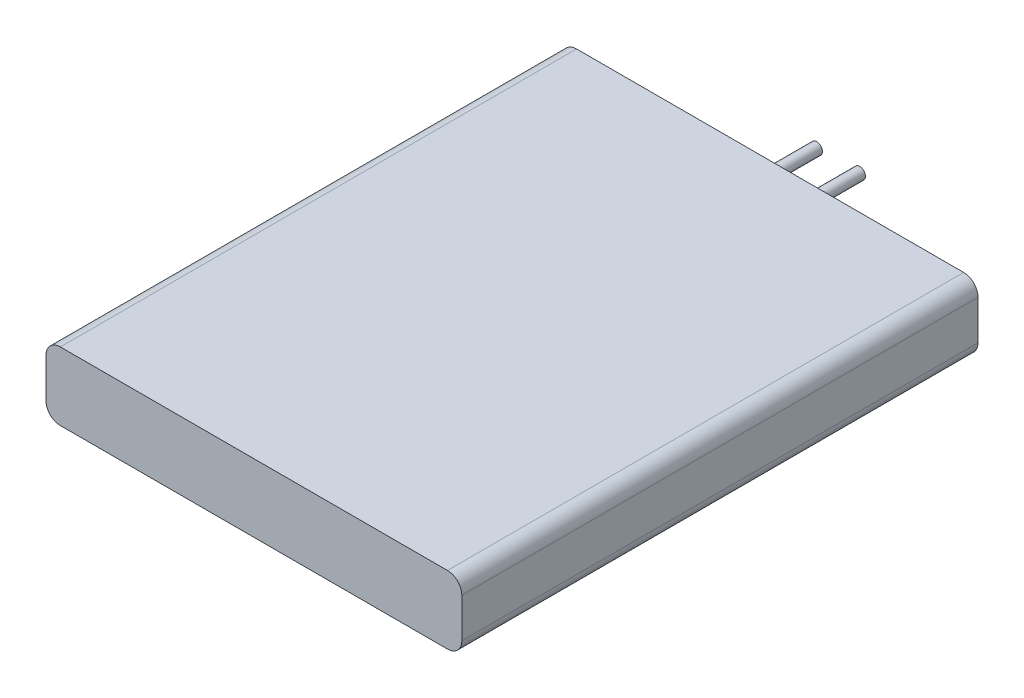
ISO-10303-21;
HEADER;
FILE_DESCRIPTION(('STEP AP214'),'2;1');
FILE_NAME('part.step','',(''),(''),'','','');
FILE_SCHEMA(('AUTOMOTIVE_DESIGN { 1 0 10303 214 1 1 1 1 }'));
ENDSEC;
DATA;
#1=APPLICATION_CONTEXT('core data for automotive mechanical design processes');
#2=APPLICATION_PROTOCOL_DEFINITION('international standard','automotive_design',2000,#1);
#3=PRODUCT_CONTEXT('',#1,'mechanical');
#4=PRODUCT('Part','Part','',(#3));
#5=PRODUCT_RELATED_PRODUCT_CATEGORY('part','',(#4));
#6=PRODUCT_DEFINITION_FORMATION('','',#4);
#7=PRODUCT_DEFINITION_CONTEXT('part definition',#1,'design');
#8=PRODUCT_DEFINITION('design','',#6,#7);
#9=PRODUCT_DEFINITION_SHAPE('','',#8);
#10=(LENGTH_UNIT() NAMED_UNIT(*) SI_UNIT(.MILLI.,.METRE.));
#11=(NAMED_UNIT(*) PLANE_ANGLE_UNIT() SI_UNIT($,.RADIAN.));
#12=(NAMED_UNIT(*) SI_UNIT($,.STERADIAN.) SOLID_ANGLE_UNIT());
#13=UNCERTAINTY_MEASURE_WITH_UNIT(LENGTH_MEASURE(1.E-05),#10,'distance_accuracy_value','');
#14=(GEOMETRIC_REPRESENTATION_CONTEXT(3) GLOBAL_UNCERTAINTY_ASSIGNED_CONTEXT((#13)) GLOBAL_UNIT_ASSIGNED_CONTEXT((#10,
#11,#12)) REPRESENTATION_CONTEXT('',''));
#15=CARTESIAN_POINT('',(0.,0.,0.));
#16=DIRECTION('',(0.,0.,1.));
#17=DIRECTION('',(1.,0.,0.));
#18=AXIS2_PLACEMENT_3D('',#15,#16,#17);
#19=CARTESIAN_POINT('',(14.5,4.75,18.));
#20=DIRECTION('',(-1.,0.,0.));
#21=DIRECTION('',(0.,0.,1.));
#22=AXIS2_PLACEMENT_3D('',#19,#20,#21);
#23=PLANE('',#22);
#24=DIRECTION('',(0.,-1.,0.));
#25=VECTOR('',#24,1.);
#26=CARTESIAN_POINT('',(14.5,4.75,18.));
#27=LINE('',#26,#25);
#28=CARTESIAN_POINT('',(14.5,3.75,18.));
#29=VERTEX_POINT('',#28);
#30=CARTESIAN_POINT('',(14.5,1.,18.));
#31=VERTEX_POINT('',#30);
#32=EDGE_CURVE('E124',#29,#31,#27,.T.);
#33=ORIENTED_EDGE('',*,*,#32,.T.);
#34=DIRECTION('',(0.,0.,-1.));
#35=VECTOR('',#34,1.);
#36=CARTESIAN_POINT('',(14.5,1.,-18.));
#37=LINE('',#36,#35);
#38=CARTESIAN_POINT('',(14.5,1.,-18.));
#39=VERTEX_POINT('',#38);
#40=EDGE_CURVE('E11',#31,#39,#37,.T.);
#41=ORIENTED_EDGE('',*,*,#40,.T.);
#42=DIRECTION('',(0.,-1.,0.));
#43=VECTOR('',#42,1.);
#44=CARTESIAN_POINT('',(14.5,4.75,-18.));
#45=LINE('',#44,#43);
#46=CARTESIAN_POINT('',(14.5,3.75,-18.));
#47=VERTEX_POINT('',#46);
#48=EDGE_CURVE('E158',#47,#39,#45,.T.);
#49=ORIENTED_EDGE('',*,*,#48,.F.);
#50=DIRECTION('',(0.,0.,-1.));
#51=VECTOR('',#50,1.);
#52=CARTESIAN_POINT('',(14.5,3.75,18.));
#53=LINE('',#52,#51);
#54=EDGE_CURVE('E44',#47,#29,#53,.F.);
#55=ORIENTED_EDGE('',*,*,#54,.T.);
#56=EDGE_LOOP('',(#33,#41,#49,#55));
#57=FACE_BOUND('',#56,.T.);
#58=ADVANCED_FACE('F36',(#57),#23,.F.);
#59=CARTESIAN_POINT('',(-14.5,4.75,-18.));
#60=DIRECTION('',(0.,0.,1.));
#61=DIRECTION('',(1.,0.,0.));
#62=AXIS2_PLACEMENT_3D('',#59,#60,#61);
#63=PLANE('',#62);
#64=CARTESIAN_POINT('',(1.5,2.375,-18.));
#65=DIRECTION('',(0.,0.,1.));
#66=DIRECTION('',(1.,0.,0.));
#67=AXIS2_PLACEMENT_3D('',#64,#65,#66);
#68=CIRCLE('',#67,0.4);
#69=CARTESIAN_POINT('',(1.9,2.375,-18.));
#70=VERTEX_POINT('',#69);
#71=EDGE_CURVE('E129',#70,#70,#68,.F.);
#72=ORIENTED_EDGE('',*,*,#71,.F.);
#73=EDGE_LOOP('',(#72));
#74=FACE_BOUND('',#73,.T.);
#75=CARTESIAN_POINT('',(-1.5,2.375,-18.));
#76=DIRECTION('',(0.,0.,1.));
#77=DIRECTION('',(1.,0.,0.));
#78=AXIS2_PLACEMENT_3D('',#75,#76,#77);
#79=CIRCLE('',#78,0.4);
#80=CARTESIAN_POINT('',(-1.1,2.375,-18.));
#81=VERTEX_POINT('',#80);
#82=EDGE_CURVE('E134',#81,#81,#79,.F.);
#83=ORIENTED_EDGE('',*,*,#82,.F.);
#84=EDGE_LOOP('',(#83));
#85=FACE_BOUND('',#84,.T.);
#86=DIRECTION('',(-1.,0.,0.));
#87=VECTOR('',#86,1.);
#88=CARTESIAN_POINT('',(-14.5,0.,-18.));
#89=LINE('',#88,#87);
#90=CARTESIAN_POINT('',(13.5,0.,-18.));
#91=VERTEX_POINT('',#90);
#92=CARTESIAN_POINT('',(-13.5,0.,-18.));
#93=VERTEX_POINT('',#92);
#94=EDGE_CURVE('E174',#91,#93,#89,.T.);
#95=ORIENTED_EDGE('',*,*,#94,.T.);
#96=CARTESIAN_POINT('',(-13.5,1.,-18.));
#97=DIRECTION('',(0.,0.,1.));
#98=DIRECTION('',(1.,0.,0.));
#99=AXIS2_PLACEMENT_3D('',#96,#97,#98);
#100=CIRCLE('',#99,1.);
#101=CARTESIAN_POINT('',(-14.5,1.,-18.));
#102=VERTEX_POINT('',#101);
#103=EDGE_CURVE('E148',#93,#102,#100,.F.);
#104=ORIENTED_EDGE('',*,*,#103,.T.);
#105=DIRECTION('',(0.,-1.,0.));
#106=VECTOR('',#105,1.);
#107=CARTESIAN_POINT('',(-14.5,4.75,-18.));
#108=LINE('',#107,#106);
#109=CARTESIAN_POINT('',(-14.5,3.75,-18.));
#110=VERTEX_POINT('',#109);
#111=EDGE_CURVE('E123',#110,#102,#108,.T.);
#112=ORIENTED_EDGE('',*,*,#111,.F.);
#113=CARTESIAN_POINT('',(-13.5,3.75,-18.));
#114=DIRECTION('',(0.,0.,1.));
#115=DIRECTION('',(1.,0.,0.));
#116=AXIS2_PLACEMENT_3D('',#113,#114,#115);
#117=CIRCLE('',#116,1.);
#118=CARTESIAN_POINT('',(-13.5,4.75,-18.));
#119=VERTEX_POINT('',#118);
#120=EDGE_CURVE('E128',#110,#119,#117,.F.);
#121=ORIENTED_EDGE('',*,*,#120,.T.);
#122=DIRECTION('',(-1.,0.,0.));
#123=VECTOR('',#122,1.);
#124=CARTESIAN_POINT('',(-14.5,4.75,-18.));
#125=LINE('',#124,#123);
#126=CARTESIAN_POINT('',(13.5,4.75,-18.));
#127=VERTEX_POINT('',#126);
#128=EDGE_CURVE('E168',#127,#119,#125,.T.);
#129=ORIENTED_EDGE('',*,*,#128,.F.);
#130=CARTESIAN_POINT('',(13.5,3.75,-18.));
#131=DIRECTION('',(0.,0.,1.));
#132=DIRECTION('',(1.,0.,0.));
#133=AXIS2_PLACEMENT_3D('',#130,#131,#132);
#134=CIRCLE('',#133,1.);
#135=EDGE_CURVE('E58',#127,#47,#134,.F.);
#136=ORIENTED_EDGE('',*,*,#135,.T.);
#137=ORIENTED_EDGE('',*,*,#48,.T.);
#138=CARTESIAN_POINT('',(13.5,1.,-18.));
#139=DIRECTION('',(0.,0.,1.));
#140=DIRECTION('',(1.,0.,0.));
#141=AXIS2_PLACEMENT_3D('',#138,#139,#140);
#142=CIRCLE('',#141,1.);
#143=EDGE_CURVE('E51',#39,#91,#142,.F.);
#144=ORIENTED_EDGE('',*,*,#143,.T.);
#145=EDGE_LOOP('',(#95,#104,#112,#121,#129,#136,#137,#144));
#146=FACE_BOUND('',#145,.T.);
#147=ADVANCED_FACE('F170',(#74,#85,#146),#63,.F.);
#148=CARTESIAN_POINT('',(-14.5,4.75,18.));
#149=DIRECTION('',(1.,0.,0.));
#150=DIRECTION('',(0.,0.,-1.));
#151=AXIS2_PLACEMENT_3D('',#148,#149,#150);
#152=PLANE('',#151);
#153=ORIENTED_EDGE('',*,*,#111,.T.);
#154=DIRECTION('',(0.,0.,1.));
#155=VECTOR('',#154,1.);
#156=CARTESIAN_POINT('',(-14.5,1.,18.));
#157=LINE('',#156,#155);
#158=CARTESIAN_POINT('',(-14.5,1.,18.));
#159=VERTEX_POINT('',#158);
#160=EDGE_CURVE('E122',#102,#159,#157,.T.);
#161=ORIENTED_EDGE('',*,*,#160,.T.);
#162=DIRECTION('',(0.,-1.,0.));
#163=VECTOR('',#162,1.);
#164=CARTESIAN_POINT('',(-14.5,4.75,18.));
#165=LINE('',#164,#163);
#166=CARTESIAN_POINT('',(-14.5,3.75,18.));
#167=VERTEX_POINT('',#166);
#168=EDGE_CURVE('E105',#167,#159,#165,.T.);
#169=ORIENTED_EDGE('',*,*,#168,.F.);
#170=DIRECTION('',(0.,0.,1.));
#171=VECTOR('',#170,1.);
#172=CARTESIAN_POINT('',(-14.5,3.75,18.));
#173=LINE('',#172,#171);
#174=EDGE_CURVE('E119',#167,#110,#173,.F.);
#175=ORIENTED_EDGE('',*,*,#174,.T.);
#176=EDGE_LOOP('',(#153,#161,#169,#175));
#177=FACE_BOUND('',#176,.T.);
#178=ADVANCED_FACE('F118',(#177),#152,.F.);
#179=CARTESIAN_POINT('',(-14.5,4.75,18.));
#180=DIRECTION('',(0.,0.,-1.));
#181=DIRECTION('',(-1.,0.,0.));
#182=AXIS2_PLACEMENT_3D('',#179,#180,#181);
#183=PLANE('',#182);
#184=ORIENTED_EDGE('',*,*,#168,.T.);
#185=CARTESIAN_POINT('',(-13.5,1.,18.));
#186=DIRECTION('',(0.,0.,-1.));
#187=DIRECTION('',(-1.,0.,0.));
#188=AXIS2_PLACEMENT_3D('',#185,#186,#187);
#189=CIRCLE('',#188,1.);
#190=CARTESIAN_POINT('',(-13.5,0.,18.));
#191=VERTEX_POINT('',#190);
#192=EDGE_CURVE('E112',#159,#191,#189,.F.);
#193=ORIENTED_EDGE('',*,*,#192,.T.);
#194=DIRECTION('',(1.,0.,0.));
#195=VECTOR('',#194,1.);
#196=CARTESIAN_POINT('',(-14.5,0.,18.));
#197=LINE('',#196,#195);
#198=CARTESIAN_POINT('',(13.5,0.,18.));
#199=VERTEX_POINT('',#198);
#200=EDGE_CURVE('E171',#191,#199,#197,.T.);
#201=ORIENTED_EDGE('',*,*,#200,.T.);
#202=CARTESIAN_POINT('',(13.5,1.,18.));
#203=DIRECTION('',(0.,0.,-1.));
#204=DIRECTION('',(-1.,0.,0.));
#205=AXIS2_PLACEMENT_3D('',#202,#203,#204);
#206=CIRCLE('',#205,1.);
#207=EDGE_CURVE('E113',#199,#31,#206,.F.);
#208=ORIENTED_EDGE('',*,*,#207,.T.);
#209=ORIENTED_EDGE('',*,*,#32,.F.);
#210=CARTESIAN_POINT('',(13.5,3.75,18.));
#211=DIRECTION('',(0.,0.,-1.));
#212=DIRECTION('',(-1.,0.,0.));
#213=AXIS2_PLACEMENT_3D('',#210,#211,#212);
#214=CIRCLE('',#213,1.);
#215=CARTESIAN_POINT('',(13.5,4.75,18.));
#216=VERTEX_POINT('',#215);
#217=EDGE_CURVE('E131',#29,#216,#214,.F.);
#218=ORIENTED_EDGE('',*,*,#217,.T.);
#219=DIRECTION('',(1.,0.,0.));
#220=VECTOR('',#219,1.);
#221=CARTESIAN_POINT('',(-14.5,4.75,18.));
#222=LINE('',#221,#220);
#223=CARTESIAN_POINT('',(-13.5,4.75,18.));
#224=VERTEX_POINT('',#223);
#225=EDGE_CURVE('E107',#224,#216,#222,.T.);
#226=ORIENTED_EDGE('',*,*,#225,.F.);
#227=CARTESIAN_POINT('',(-13.5,3.75,18.));
#228=DIRECTION('',(0.,0.,-1.));
#229=DIRECTION('',(-1.,0.,0.));
#230=AXIS2_PLACEMENT_3D('',#227,#228,#229);
#231=CIRCLE('',#230,1.);
#232=EDGE_CURVE('E102',#224,#167,#231,.F.);
#233=ORIENTED_EDGE('',*,*,#232,.T.);
#234=EDGE_LOOP('',(#184,#193,#201,#208,#209,#218,#226,#233));
#235=FACE_BOUND('',#234,.T.);
#236=ADVANCED_FACE('F104',(#235),#183,.F.);
#237=CARTESIAN_POINT('',(0.,4.75,0.));
#238=DIRECTION('',(0.,-1.,0.));
#239=DIRECTION('',(0.,0.,-1.));
#240=AXIS2_PLACEMENT_3D('',#237,#238,#239);
#241=PLANE('',#240);
#242=ORIENTED_EDGE('',*,*,#128,.T.);
#243=DIRECTION('',(0.,0.,1.));
#244=VECTOR('',#243,1.);
#245=CARTESIAN_POINT('',(-13.5,4.75,0.));
#246=LINE('',#245,#244);
#247=EDGE_CURVE('E153',#119,#224,#246,.T.);
#248=ORIENTED_EDGE('',*,*,#247,.T.);
#249=ORIENTED_EDGE('',*,*,#225,.T.);
#250=DIRECTION('',(0.,0.,-1.));
#251=VECTOR('',#250,1.);
#252=CARTESIAN_POINT('',(13.5,4.75,0.));
#253=LINE('',#252,#251);
#254=EDGE_CURVE('E150',#216,#127,#253,.T.);
#255=ORIENTED_EDGE('',*,*,#254,.T.);
#256=EDGE_LOOP('',(#242,#248,#249,#255));
#257=FACE_BOUND('',#256,.T.);
#258=ADVANCED_FACE('F167',(#257),#241,.F.);
#259=CARTESIAN_POINT('',(0.,0.,0.));
#260=DIRECTION('',(0.,-1.,0.));
#261=DIRECTION('',(0.,0.,-1.));
#262=AXIS2_PLACEMENT_3D('',#259,#260,#261);
#263=PLANE('',#262);
#264=ORIENTED_EDGE('',*,*,#200,.F.);
#265=DIRECTION('',(0.,0.,1.));
#266=VECTOR('',#265,1.);
#267=CARTESIAN_POINT('',(-13.5,0.,-18.));
#268=LINE('',#267,#266);
#269=EDGE_CURVE('E143',#191,#93,#268,.F.);
#270=ORIENTED_EDGE('',*,*,#269,.T.);
#271=ORIENTED_EDGE('',*,*,#94,.F.);
#272=DIRECTION('',(0.,0.,-1.));
#273=VECTOR('',#272,1.);
#274=CARTESIAN_POINT('',(13.5,0.,18.));
#275=LINE('',#274,#273);
#276=EDGE_CURVE('E141',#91,#199,#275,.F.);
#277=ORIENTED_EDGE('',*,*,#276,.T.);
#278=EDGE_LOOP('',(#264,#270,#271,#277));
#279=FACE_BOUND('',#278,.T.);
#280=ADVANCED_FACE('F214',(#279),#263,.T.);
#281=CARTESIAN_POINT('',(-1.5,2.375,-22.75));
#282=DIRECTION('',(0.,0.,1.));
#283=DIRECTION('',(1.,0.,0.));
#284=AXIS2_PLACEMENT_3D('',#281,#282,#283);
#285=CYLINDRICAL_SURFACE('',#284,0.4);
#286=CARTESIAN_POINT('',(-1.5,2.375,-22.75));
#287=DIRECTION('',(0.,0.,-1.));
#288=DIRECTION('',(-1.,0.,0.));
#289=AXIS2_PLACEMENT_3D('',#286,#287,#288);
#290=CIRCLE('',#289,0.4);
#291=CARTESIAN_POINT('',(-1.9,2.375,-22.75));
#292=VERTEX_POINT('',#291);
#293=EDGE_CURVE('E177',#292,#292,#290,.T.);
#294=ORIENTED_EDGE('',*,*,#293,.F.);
#295=EDGE_LOOP('',(#294));
#296=FACE_BOUND('',#295,.T.);
#297=ORIENTED_EDGE('',*,*,#82,.T.);
#298=EDGE_LOOP('',(#297));
#299=FACE_BOUND('',#298,.T.);
#300=ADVANCED_FACE('F185',(#296,#299),#285,.T.);
#301=CARTESIAN_POINT('',(-1.5,2.375,-22.75));
#302=DIRECTION('',(0.,0.,-1.));
#303=DIRECTION('',(-1.,0.,0.));
#304=AXIS2_PLACEMENT_3D('',#301,#302,#303);
#305=PLANE('',#304);
#306=ORIENTED_EDGE('',*,*,#293,.T.);
#307=EDGE_LOOP('',(#306));
#308=FACE_BOUND('',#307,.T.);
#309=ADVANCED_FACE('F222',(#308),#305,.T.);
#310=CARTESIAN_POINT('',(1.5,2.375,-22.75));
#311=DIRECTION('',(0.,0.,1.));
#312=DIRECTION('',(1.,0.,0.));
#313=AXIS2_PLACEMENT_3D('',#310,#311,#312);
#314=CYLINDRICAL_SURFACE('',#313,0.4);
#315=CARTESIAN_POINT('',(1.5,2.375,-22.75));
#316=DIRECTION('',(0.,0.,-1.));
#317=DIRECTION('',(1.,0.,0.));
#318=AXIS2_PLACEMENT_3D('',#315,#316,#317);
#319=CIRCLE('',#318,0.4);
#320=CARTESIAN_POINT('',(1.9,2.375,-22.75));
#321=VERTEX_POINT('',#320);
#322=EDGE_CURVE('E325',#321,#321,#319,.T.);
#323=ORIENTED_EDGE('',*,*,#322,.F.);
#324=EDGE_LOOP('',(#323));
#325=FACE_BOUND('',#324,.T.);
#326=ORIENTED_EDGE('',*,*,#71,.T.);
#327=EDGE_LOOP('',(#326));
#328=FACE_BOUND('',#327,.T.);
#329=ADVANCED_FACE('F271',(#325,#328),#314,.T.);
#330=CARTESIAN_POINT('',(1.5,2.375,-22.75));
#331=DIRECTION('',(0.,0.,1.));
#332=DIRECTION('',(1.,0.,0.));
#333=AXIS2_PLACEMENT_3D('',#330,#331,#332);
#334=PLANE('',#333);
#335=ORIENTED_EDGE('',*,*,#322,.T.);
#336=EDGE_LOOP('',(#335));
#337=FACE_BOUND('',#336,.T.);
#338=ADVANCED_FACE('F202',(#337),#334,.F.);
#339=CARTESIAN_POINT('',(-13.5,1.,18.));
#340=DIRECTION('',(0.,0.,-1.));
#341=DIRECTION('',(-1.,0.,0.));
#342=AXIS2_PLACEMENT_3D('',#339,#340,#341);
#343=CYLINDRICAL_SURFACE('',#342,1.);
#344=ORIENTED_EDGE('',*,*,#103,.F.);
#345=ORIENTED_EDGE('',*,*,#269,.F.);
#346=ORIENTED_EDGE('',*,*,#192,.F.);
#347=ORIENTED_EDGE('',*,*,#160,.F.);
#348=EDGE_LOOP('',(#344,#345,#346,#347));
#349=FACE_BOUND('',#348,.T.);
#350=ADVANCED_FACE('F199',(#349),#343,.T.);
#351=CARTESIAN_POINT('',(-13.5,3.75,0.));
#352=DIRECTION('',(0.,0.,1.));
#353=DIRECTION('',(1.,0.,0.));
#354=AXIS2_PLACEMENT_3D('',#351,#352,#353);
#355=CYLINDRICAL_SURFACE('',#354,1.);
#356=ORIENTED_EDGE('',*,*,#120,.F.);
#357=ORIENTED_EDGE('',*,*,#174,.F.);
#358=ORIENTED_EDGE('',*,*,#232,.F.);
#359=ORIENTED_EDGE('',*,*,#247,.F.);
#360=EDGE_LOOP('',(#356,#357,#358,#359));
#361=FACE_BOUND('',#360,.T.);
#362=ADVANCED_FACE('F127',(#361),#355,.T.);
#363=CARTESIAN_POINT('',(13.5,1.,18.));
#364=DIRECTION('',(0.,0.,1.));
#365=DIRECTION('',(1.,0.,0.));
#366=AXIS2_PLACEMENT_3D('',#363,#364,#365);
#367=CYLINDRICAL_SURFACE('',#366,1.);
#368=ORIENTED_EDGE('',*,*,#207,.F.);
#369=ORIENTED_EDGE('',*,*,#276,.F.);
#370=ORIENTED_EDGE('',*,*,#143,.F.);
#371=ORIENTED_EDGE('',*,*,#40,.F.);
#372=EDGE_LOOP('',(#368,#369,#370,#371));
#373=FACE_BOUND('',#372,.T.);
#374=ADVANCED_FACE('F205',(#373),#367,.T.);
#375=CARTESIAN_POINT('',(13.5,3.75,0.));
#376=DIRECTION('',(0.,0.,-1.));
#377=DIRECTION('',(-1.,0.,0.));
#378=AXIS2_PLACEMENT_3D('',#375,#376,#377);
#379=CYLINDRICAL_SURFACE('',#378,1.);
#380=ORIENTED_EDGE('',*,*,#217,.F.);
#381=ORIENTED_EDGE('',*,*,#54,.F.);
#382=ORIENTED_EDGE('',*,*,#135,.F.);
#383=ORIENTED_EDGE('',*,*,#254,.F.);
#384=EDGE_LOOP('',(#380,#381,#382,#383));
#385=FACE_BOUND('',#384,.T.);
#386=ADVANCED_FACE('F38',(#385),#379,.T.);
#387=CLOSED_SHELL('',(#58,#147,#178,#236,#258,#280,#300,#309,#329,#338,#350,#362,#374,#386));
#388=MANIFOLD_SOLID_BREP('B2',#387);
#389=ADVANCED_BREP_SHAPE_REPRESENTATION('',(#18,#388),#14);
#390=SHAPE_DEFINITION_REPRESENTATION(#9,#389);
ENDSEC;
END-ISO-10303-21;
